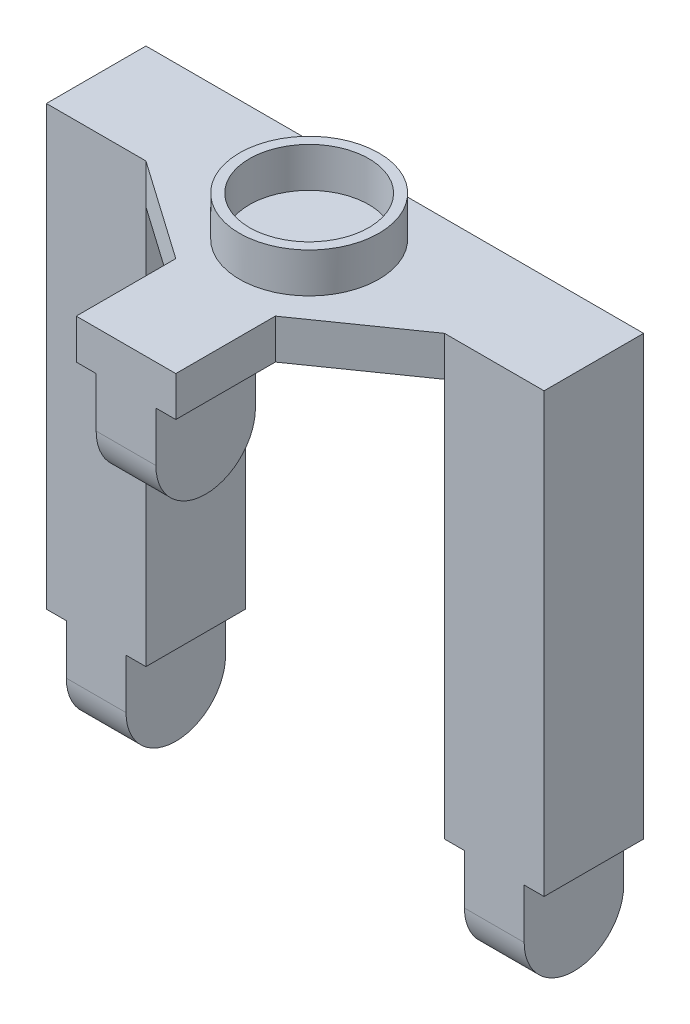
ISO-10303-21;
HEADER;
FILE_DESCRIPTION(('STEP AP214'),'2;1');
FILE_NAME('part.step','',(''),(''),'','','');
FILE_SCHEMA(('AUTOMOTIVE_DESIGN { 1 0 10303 214 1 1 1 1 }'));
ENDSEC;
DATA;
#1=APPLICATION_CONTEXT('core data for automotive mechanical design processes');
#2=APPLICATION_PROTOCOL_DEFINITION('international standard','automotive_design',2000,#1);
#3=PRODUCT_CONTEXT('',#1,'mechanical');
#4=PRODUCT('Part','Part','',(#3));
#5=PRODUCT_RELATED_PRODUCT_CATEGORY('part','',(#4));
#6=PRODUCT_DEFINITION_FORMATION('','',#4);
#7=PRODUCT_DEFINITION_CONTEXT('part definition',#1,'design');
#8=PRODUCT_DEFINITION('design','',#6,#7);
#9=PRODUCT_DEFINITION_SHAPE('','',#8);
#10=(LENGTH_UNIT() NAMED_UNIT(*) SI_UNIT(.MILLI.,.METRE.));
#11=(NAMED_UNIT(*) PLANE_ANGLE_UNIT() SI_UNIT($,.RADIAN.));
#12=(NAMED_UNIT(*) SI_UNIT($,.STERADIAN.) SOLID_ANGLE_UNIT());
#13=UNCERTAINTY_MEASURE_WITH_UNIT(LENGTH_MEASURE(1.E-05),#10,'distance_accuracy_value','');
#14=(GEOMETRIC_REPRESENTATION_CONTEXT(3) GLOBAL_UNCERTAINTY_ASSIGNED_CONTEXT((#13)) GLOBAL_UNIT_ASSIGNED_CONTEXT((#10,
#11,#12)) REPRESENTATION_CONTEXT('',''));
#15=CARTESIAN_POINT('',(0.,0.,0.));
#16=DIRECTION('',(0.,0.,1.));
#17=DIRECTION('',(1.,0.,0.));
#18=AXIS2_PLACEMENT_3D('',#15,#16,#17);
#19=CARTESIAN_POINT('',(-25.,4.,5.));
#20=DIRECTION('',(0.,0.,-1.));
#21=DIRECTION('',(-1.,0.,0.));
#22=AXIS2_PLACEMENT_3D('',#19,#20,#21);
#23=PLANE('',#22);
#24=DIRECTION('',(1.,0.,0.));
#25=VECTOR('',#24,1.);
#26=CARTESIAN_POINT('',(-25.,-45.,5.00000000000001));
#27=LINE('',#26,#25);
#28=CARTESIAN_POINT('',(-23.,-45.,5.00000000000001));
#29=VERTEX_POINT('',#28);
#30=CARTESIAN_POINT('',(-17.,-45.,5.00000000000001));
#31=VERTEX_POINT('',#30);
#32=EDGE_CURVE('E199',#29,#31,#27,.T.);
#33=ORIENTED_EDGE('',*,*,#32,.T.);
#34=DIRECTION('',(0.,1.,0.));
#35=VECTOR('',#34,1.);
#36=CARTESIAN_POINT('',(-17.,4.,5.));
#37=LINE('',#36,#35);
#38=CARTESIAN_POINT('',(-17.,-40.,5.));
#39=VERTEX_POINT('',#38);
#40=EDGE_CURVE('E224',#31,#39,#37,.T.);
#41=ORIENTED_EDGE('',*,*,#40,.T.);
#42=DIRECTION('',(1.,0.,0.));
#43=VECTOR('',#42,1.);
#44=CARTESIAN_POINT('',(-25.,-40.,5.));
#45=LINE('',#44,#43);
#46=CARTESIAN_POINT('',(-15.,-40.,5.));
#47=VERTEX_POINT('',#46);
#48=EDGE_CURVE('E225',#39,#47,#45,.T.);
#49=ORIENTED_EDGE('',*,*,#48,.T.);
#50=DIRECTION('',(0.,1.,0.));
#51=VECTOR('',#50,1.);
#52=CARTESIAN_POINT('',(-15.,-50.,5.));
#53=LINE('',#52,#51);
#54=CARTESIAN_POINT('',(-15.,0.,5.));
#55=VERTEX_POINT('',#54);
#56=EDGE_CURVE('E251',#47,#55,#53,.T.);
#57=ORIENTED_EDGE('',*,*,#56,.T.);
#58=DIRECTION('',(0.,-1.,0.));
#59=VECTOR('',#58,1.);
#60=CARTESIAN_POINT('',(-15.,4.,5.));
#61=LINE('',#60,#59);
#62=CARTESIAN_POINT('',(-15.,4.,5.));
#63=VERTEX_POINT('',#62);
#64=EDGE_CURVE('E309',#63,#55,#61,.T.);
#65=ORIENTED_EDGE('',*,*,#64,.F.);
#66=DIRECTION('',(1.,0.,0.));
#67=VECTOR('',#66,1.);
#68=CARTESIAN_POINT('',(-25.,4.,5.));
#69=LINE('',#68,#67);
#70=CARTESIAN_POINT('',(-25.,4.,5.));
#71=VERTEX_POINT('',#70);
#72=EDGE_CURVE('E257',#71,#63,#69,.T.);
#73=ORIENTED_EDGE('',*,*,#72,.F.);
#74=DIRECTION('',(0.,-1.,0.));
#75=VECTOR('',#74,1.);
#76=CARTESIAN_POINT('',(-25.,4.,5.));
#77=LINE('',#76,#75);
#78=CARTESIAN_POINT('',(-25.,-40.,5.));
#79=VERTEX_POINT('',#78);
#80=EDGE_CURVE('E279',#71,#79,#77,.T.);
#81=ORIENTED_EDGE('',*,*,#80,.T.);
#82=DIRECTION('',(1.,0.,0.));
#83=VECTOR('',#82,1.);
#84=CARTESIAN_POINT('',(-25.,-40.,5.));
#85=LINE('',#84,#83);
#86=CARTESIAN_POINT('',(-23.,-40.,5.));
#87=VERTEX_POINT('',#86);
#88=EDGE_CURVE('E223',#79,#87,#85,.T.);
#89=ORIENTED_EDGE('',*,*,#88,.T.);
#90=DIRECTION('',(0.,-1.,0.));
#91=VECTOR('',#90,1.);
#92=CARTESIAN_POINT('',(-23.,4.,5.));
#93=LINE('',#92,#91);
#94=EDGE_CURVE('E215',#87,#29,#93,.T.);
#95=ORIENTED_EDGE('',*,*,#94,.T.);
#96=EDGE_LOOP('',(#33,#41,#49,#57,#65,#73,#81,#89,#95));
#97=FACE_BOUND('',#96,.T.);
#98=ADVANCED_FACE('F34',(#97),#23,.F.);
#99=CARTESIAN_POINT('',(-5.,4.,22.));
#100=DIRECTION('',(0.,0.,-1.));
#101=DIRECTION('',(-1.,0.,0.));
#102=AXIS2_PLACEMENT_3D('',#99,#100,#101);
#103=PLANE('',#102);
#104=DIRECTION('',(1.,0.,0.));
#105=VECTOR('',#104,1.);
#106=CARTESIAN_POINT('',(-25.,-5.,22.));
#107=LINE('',#106,#105);
#108=CARTESIAN_POINT('',(-3.,-5.,22.));
#109=VERTEX_POINT('',#108);
#110=CARTESIAN_POINT('',(3.,-5.,22.));
#111=VERTEX_POINT('',#110);
#112=EDGE_CURVE('E48',#109,#111,#107,.T.);
#113=ORIENTED_EDGE('',*,*,#112,.T.);
#114=DIRECTION('',(0.,1.,0.));
#115=VECTOR('',#114,1.);
#116=CARTESIAN_POINT('',(3.,-10.,22.));
#117=LINE('',#116,#115);
#118=CARTESIAN_POINT('',(3.,0.,22.));
#119=VERTEX_POINT('',#118);
#120=EDGE_CURVE('E331',#111,#119,#117,.T.);
#121=ORIENTED_EDGE('',*,*,#120,.T.);
#122=DIRECTION('',(1.,0.,0.));
#123=VECTOR('',#122,1.);
#124=CARTESIAN_POINT('',(7.92883032803164,0.,22.));
#125=LINE('',#124,#123);
#126=CARTESIAN_POINT('',(5.,0.,22.));
#127=VERTEX_POINT('',#126);
#128=EDGE_CURVE('E360',#119,#127,#125,.T.);
#129=ORIENTED_EDGE('',*,*,#128,.T.);
#130=DIRECTION('',(0.,-1.,0.));
#131=VECTOR('',#130,1.);
#132=CARTESIAN_POINT('',(5.,4.,22.));
#133=LINE('',#132,#131);
#134=CARTESIAN_POINT('',(5.,4.,22.));
#135=VERTEX_POINT('',#134);
#136=EDGE_CURVE('E300',#135,#127,#133,.T.);
#137=ORIENTED_EDGE('',*,*,#136,.F.);
#138=DIRECTION('',(1.,0.,0.));
#139=VECTOR('',#138,1.);
#140=CARTESIAN_POINT('',(-5.,4.,22.));
#141=LINE('',#140,#139);
#142=CARTESIAN_POINT('',(-5.,4.,22.));
#143=VERTEX_POINT('',#142);
#144=EDGE_CURVE('E265',#143,#135,#141,.T.);
#145=ORIENTED_EDGE('',*,*,#144,.F.);
#146=DIRECTION('',(0.,-1.,0.));
#147=VECTOR('',#146,1.);
#148=CARTESIAN_POINT('',(-5.,4.,22.));
#149=LINE('',#148,#147);
#150=CARTESIAN_POINT('',(-5.,0.,22.));
#151=VERTEX_POINT('',#150);
#152=EDGE_CURVE('E303',#143,#151,#149,.T.);
#153=ORIENTED_EDGE('',*,*,#152,.T.);
#154=DIRECTION('',(1.,0.,0.));
#155=VECTOR('',#154,1.);
#156=CARTESIAN_POINT('',(-3.,0.,22.));
#157=LINE('',#156,#155);
#158=CARTESIAN_POINT('',(-3.,0.,22.));
#159=VERTEX_POINT('',#158);
#160=EDGE_CURVE('E328',#151,#159,#157,.T.);
#161=ORIENTED_EDGE('',*,*,#160,.T.);
#162=DIRECTION('',(0.,-1.,0.));
#163=VECTOR('',#162,1.);
#164=CARTESIAN_POINT('',(-3.,-10.,22.));
#165=LINE('',#164,#163);
#166=EDGE_CURVE('E320',#159,#109,#165,.T.);
#167=ORIENTED_EDGE('',*,*,#166,.T.);
#168=EDGE_LOOP('',(#113,#121,#129,#137,#145,#153,#161,#167));
#169=FACE_BOUND('',#168,.T.);
#170=ADVANCED_FACE('F326',(#169),#103,.F.);
#171=CARTESIAN_POINT('',(15.,4.,5.));
#172=DIRECTION('',(0.,0.,-1.));
#173=DIRECTION('',(-1.,0.,0.));
#174=AXIS2_PLACEMENT_3D('',#171,#172,#173);
#175=PLANE('',#174);
#176=CARTESIAN_POINT('',(17.,-45.,4.99999999999999));
#177=VERTEX_POINT('',#176);
#178=CARTESIAN_POINT('',(23.,-45.,4.99999999999999));
#179=VERTEX_POINT('',#178);
#180=EDGE_CURVE('E210',#177,#179,#27,.T.);
#181=ORIENTED_EDGE('',*,*,#180,.T.);
#182=DIRECTION('',(0.,1.,0.));
#183=VECTOR('',#182,1.);
#184=CARTESIAN_POINT('',(23.,4.,5.));
#185=LINE('',#184,#183);
#186=CARTESIAN_POINT('',(23.,-40.,5.));
#187=VERTEX_POINT('',#186);
#188=EDGE_CURVE('E378',#179,#187,#185,.T.);
#189=ORIENTED_EDGE('',*,*,#188,.T.);
#190=DIRECTION('',(1.,0.,0.));
#191=VECTOR('',#190,1.);
#192=CARTESIAN_POINT('',(15.,-40.,5.));
#193=LINE('',#192,#191);
#194=CARTESIAN_POINT('',(25.,-40.,5.));
#195=VERTEX_POINT('',#194);
#196=EDGE_CURVE('E234',#187,#195,#193,.T.);
#197=ORIENTED_EDGE('',*,*,#196,.T.);
#198=DIRECTION('',(0.,-1.,0.));
#199=VECTOR('',#198,1.);
#200=CARTESIAN_POINT('',(25.,4.,5.));
#201=LINE('',#200,#199);
#202=CARTESIAN_POINT('',(25.,4.,5.));
#203=VERTEX_POINT('',#202);
#204=EDGE_CURVE('E291',#203,#195,#201,.T.);
#205=ORIENTED_EDGE('',*,*,#204,.F.);
#206=DIRECTION('',(1.,0.,0.));
#207=VECTOR('',#206,1.);
#208=CARTESIAN_POINT('',(15.,4.,5.));
#209=LINE('',#208,#207);
#210=CARTESIAN_POINT('',(15.,4.,5.));
#211=VERTEX_POINT('',#210);
#212=EDGE_CURVE('E271',#211,#203,#209,.T.);
#213=ORIENTED_EDGE('',*,*,#212,.F.);
#214=DIRECTION('',(0.,-1.,0.));
#215=VECTOR('',#214,1.);
#216=CARTESIAN_POINT('',(15.,4.,5.));
#217=LINE('',#216,#215);
#218=CARTESIAN_POINT('',(15.,0.,5.));
#219=VERTEX_POINT('',#218);
#220=EDGE_CURVE('E294',#211,#219,#217,.T.);
#221=ORIENTED_EDGE('',*,*,#220,.T.);
#222=DIRECTION('',(0.,1.,0.));
#223=VECTOR('',#222,1.);
#224=CARTESIAN_POINT('',(15.,-50.,5.));
#225=LINE('',#224,#223);
#226=CARTESIAN_POINT('',(15.,-40.,5.));
#227=VERTEX_POINT('',#226);
#228=EDGE_CURVE('E243',#227,#219,#225,.T.);
#229=ORIENTED_EDGE('',*,*,#228,.F.);
#230=DIRECTION('',(1.,0.,0.));
#231=VECTOR('',#230,1.);
#232=CARTESIAN_POINT('',(15.,-40.,5.));
#233=LINE('',#232,#231);
#234=CARTESIAN_POINT('',(17.,-40.,5.));
#235=VERTEX_POINT('',#234);
#236=EDGE_CURVE('E380',#227,#235,#233,.T.);
#237=ORIENTED_EDGE('',*,*,#236,.T.);
#238=DIRECTION('',(0.,-1.,0.));
#239=VECTOR('',#238,1.);
#240=CARTESIAN_POINT('',(17.,4.,5.));
#241=LINE('',#240,#239);
#242=EDGE_CURVE('E375',#235,#177,#241,.T.);
#243=ORIENTED_EDGE('',*,*,#242,.T.);
#244=EDGE_LOOP('',(#181,#189,#197,#205,#213,#221,#229,#237,#243));
#245=FACE_BOUND('',#244,.T.);
#246=ADVANCED_FACE('F450',(#245),#175,.F.);
#247=CARTESIAN_POINT('',(0.,0.,0.));
#248=DIRECTION('',(0.,-1.,0.));
#249=DIRECTION('',(0.,0.,-1.));
#250=AXIS2_PLACEMENT_3D('',#247,#248,#249);
#251=PLANE('',#250);
#252=DIRECTION('',(0.,0.,-1.));
#253=VECTOR('',#252,1.);
#254=CARTESIAN_POINT('',(-15.,0.,-5.));
#255=LINE('',#254,#253);
#256=CARTESIAN_POINT('',(-15.,0.,-5.));
#257=VERTEX_POINT('',#256);
#258=EDGE_CURVE('E246',#55,#257,#255,.T.);
#259=ORIENTED_EDGE('',*,*,#258,.T.);
#260=DIRECTION('',(-1.,0.,0.));
#261=VECTOR('',#260,1.);
#262=CARTESIAN_POINT('',(25.,0.,-5.));
#263=LINE('',#262,#261);
#264=CARTESIAN_POINT('',(15.,0.,-5.));
#265=VERTEX_POINT('',#264);
#266=EDGE_CURVE('E261',#265,#257,#263,.T.);
#267=ORIENTED_EDGE('',*,*,#266,.F.);
#268=DIRECTION('',(0.,0.,1.));
#269=VECTOR('',#268,1.);
#270=CARTESIAN_POINT('',(15.,0.,-5.));
#271=LINE('',#270,#269);
#272=EDGE_CURVE('E240',#265,#219,#271,.T.);
#273=ORIENTED_EDGE('',*,*,#272,.T.);
#274=DIRECTION('',(0.81923192051904,0.,-0.573462344363329));
#275=VECTOR('',#274,1.);
#276=CARTESIAN_POINT('',(5.,0.,12.));
#277=LINE('',#276,#275);
#278=CARTESIAN_POINT('',(5.,0.,12.));
#279=VERTEX_POINT('',#278);
#280=EDGE_CURVE('E281',#279,#219,#277,.T.);
#281=ORIENTED_EDGE('',*,*,#280,.F.);
#282=DIRECTION('',(0.,0.,-1.));
#283=VECTOR('',#282,1.);
#284=CARTESIAN_POINT('',(5.,0.,22.));
#285=LINE('',#284,#283);
#286=EDGE_CURVE('E370',#127,#279,#285,.T.);
#287=ORIENTED_EDGE('',*,*,#286,.F.);
#288=ORIENTED_EDGE('',*,*,#128,.F.);
#289=DIRECTION('',(0.,0.,-1.));
#290=VECTOR('',#289,1.);
#291=CARTESIAN_POINT('',(3.,0.,22.));
#292=LINE('',#291,#290);
#293=CARTESIAN_POINT('',(3.,0.,12.));
#294=VERTEX_POINT('',#293);
#295=EDGE_CURVE('E352',#119,#294,#292,.T.);
#296=ORIENTED_EDGE('',*,*,#295,.T.);
#297=DIRECTION('',(1.,0.,0.));
#298=VECTOR('',#297,1.);
#299=CARTESIAN_POINT('',(-5.,0.,12.));
#300=LINE('',#299,#298);
#301=CARTESIAN_POINT('',(-3.,0.,12.));
#302=VERTEX_POINT('',#301);
#303=EDGE_CURVE('E237',#302,#294,#300,.T.);
#304=ORIENTED_EDGE('',*,*,#303,.F.);
#305=DIRECTION('',(0.,0.,-1.));
#306=VECTOR('',#305,1.);
#307=CARTESIAN_POINT('',(-3.,0.,22.));
#308=LINE('',#307,#306);
#309=EDGE_CURVE('E329',#159,#302,#308,.T.);
#310=ORIENTED_EDGE('',*,*,#309,.F.);
#311=ORIENTED_EDGE('',*,*,#160,.F.);
#312=DIRECTION('',(0.,0.,1.));
#313=VECTOR('',#312,1.);
#314=CARTESIAN_POINT('',(-5.,0.,12.));
#315=LINE('',#314,#313);
#316=CARTESIAN_POINT('',(-5.,0.,12.));
#317=VERTEX_POINT('',#316);
#318=EDGE_CURVE('E372',#317,#151,#315,.T.);
#319=ORIENTED_EDGE('',*,*,#318,.F.);
#320=DIRECTION('',(0.81923192051904,0.,0.573462344363328));
#321=VECTOR('',#320,1.);
#322=CARTESIAN_POINT('',(-15.,0.,5.));
#323=LINE('',#322,#321);
#324=EDGE_CURVE('E255',#55,#317,#323,.T.);
#325=ORIENTED_EDGE('',*,*,#324,.F.);
#326=EDGE_LOOP('',(#259,#267,#273,#281,#287,#288,#296,#304,#310,#311,#319,#325));
#327=FACE_BOUND('',#326,.T.);
#328=ADVANCED_FACE('F398',(#327),#251,.T.);
#329=CARTESIAN_POINT('',(-15.,4.,5.));
#330=DIRECTION('',(0.573462344363329,0.,-0.81923192051904));
#331=DIRECTION('',(-0.81923192051904,0.,-0.573462344363329));
#332=AXIS2_PLACEMENT_3D('',#329,#330,#331);
#333=PLANE('',#332);
#334=ORIENTED_EDGE('',*,*,#324,.T.);
#335=DIRECTION('',(0.,-1.,0.));
#336=VECTOR('',#335,1.);
#337=CARTESIAN_POINT('',(-5.,4.,12.));
#338=LINE('',#337,#336);
#339=CARTESIAN_POINT('',(-5.,4.,12.));
#340=VERTEX_POINT('',#339);
#341=EDGE_CURVE('E306',#340,#317,#338,.T.);
#342=ORIENTED_EDGE('',*,*,#341,.F.);
#343=DIRECTION('',(0.81923192051904,0.,0.573462344363328));
#344=VECTOR('',#343,1.);
#345=CARTESIAN_POINT('',(-15.,4.,5.));
#346=LINE('',#345,#344);
#347=EDGE_CURVE('E260',#63,#340,#346,.T.);
#348=ORIENTED_EDGE('',*,*,#347,.F.);
#349=ORIENTED_EDGE('',*,*,#64,.T.);
#350=EDGE_LOOP('',(#334,#342,#348,#349));
#351=FACE_BOUND('',#350,.T.);
#352=ADVANCED_FACE('F401',(#351),#333,.F.);
#353=CARTESIAN_POINT('',(-5.,4.,12.));
#354=DIRECTION('',(1.,0.,0.));
#355=DIRECTION('',(0.,0.,-1.));
#356=AXIS2_PLACEMENT_3D('',#353,#354,#355);
#357=PLANE('',#356);
#358=ORIENTED_EDGE('',*,*,#341,.T.);
#359=ORIENTED_EDGE('',*,*,#318,.T.);
#360=ORIENTED_EDGE('',*,*,#152,.F.);
#361=DIRECTION('',(0.,0.,1.));
#362=VECTOR('',#361,1.);
#363=CARTESIAN_POINT('',(-5.,4.,12.));
#364=LINE('',#363,#362);
#365=EDGE_CURVE('E263',#340,#143,#364,.T.);
#366=ORIENTED_EDGE('',*,*,#365,.F.);
#367=EDGE_LOOP('',(#358,#359,#360,#366));
#368=FACE_BOUND('',#367,.T.);
#369=ADVANCED_FACE('F476',(#368),#357,.F.);
#370=CARTESIAN_POINT('',(5.,4.,22.));
#371=DIRECTION('',(-1.,0.,0.));
#372=DIRECTION('',(0.,0.,1.));
#373=AXIS2_PLACEMENT_3D('',#370,#371,#372);
#374=PLANE('',#373);
#375=ORIENTED_EDGE('',*,*,#136,.T.);
#376=ORIENTED_EDGE('',*,*,#286,.T.);
#377=DIRECTION('',(0.,-1.,0.));
#378=VECTOR('',#377,1.);
#379=CARTESIAN_POINT('',(5.,4.,12.));
#380=LINE('',#379,#378);
#381=CARTESIAN_POINT('',(5.,4.,12.));
#382=VERTEX_POINT('',#381);
#383=EDGE_CURVE('E297',#382,#279,#380,.T.);
#384=ORIENTED_EDGE('',*,*,#383,.F.);
#385=DIRECTION('',(0.,0.,-1.));
#386=VECTOR('',#385,1.);
#387=CARTESIAN_POINT('',(5.,4.,22.));
#388=LINE('',#387,#386);
#389=EDGE_CURVE('E267',#135,#382,#388,.T.);
#390=ORIENTED_EDGE('',*,*,#389,.F.);
#391=EDGE_LOOP('',(#375,#376,#384,#390));
#392=FACE_BOUND('',#391,.T.);
#393=ADVANCED_FACE('F474',(#392),#374,.F.);
#394=CARTESIAN_POINT('',(5.,4.,12.));
#395=DIRECTION('',(-0.573462344363329,0.,-0.81923192051904));
#396=DIRECTION('',(-0.81923192051904,0.,0.573462344363329));
#397=AXIS2_PLACEMENT_3D('',#394,#395,#396);
#398=PLANE('',#397);
#399=ORIENTED_EDGE('',*,*,#280,.T.);
#400=ORIENTED_EDGE('',*,*,#220,.F.);
#401=DIRECTION('',(0.81923192051904,0.,-0.573462344363329));
#402=VECTOR('',#401,1.);
#403=CARTESIAN_POINT('',(5.,4.,12.));
#404=LINE('',#403,#402);
#405=EDGE_CURVE('E269',#382,#211,#404,.T.);
#406=ORIENTED_EDGE('',*,*,#405,.F.);
#407=ORIENTED_EDGE('',*,*,#383,.T.);
#408=EDGE_LOOP('',(#399,#400,#406,#407));
#409=FACE_BOUND('',#408,.T.);
#410=ADVANCED_FACE('F494',(#409),#398,.F.);
#411=CARTESIAN_POINT('',(25.,4.,5.));
#412=DIRECTION('',(-1.,0.,0.));
#413=DIRECTION('',(0.,0.,1.));
#414=AXIS2_PLACEMENT_3D('',#411,#412,#413);
#415=PLANE('',#414);
#416=ORIENTED_EDGE('',*,*,#204,.T.);
#417=DIRECTION('',(0.,0.,-1.));
#418=VECTOR('',#417,1.);
#419=CARTESIAN_POINT('',(25.,-40.,22.));
#420=LINE('',#419,#418);
#421=CARTESIAN_POINT('',(25.,-40.,-5.));
#422=VERTEX_POINT('',#421);
#423=EDGE_CURVE('E368',#195,#422,#420,.T.);
#424=ORIENTED_EDGE('',*,*,#423,.T.);
#425=DIRECTION('',(0.,-1.,0.));
#426=VECTOR('',#425,1.);
#427=CARTESIAN_POINT('',(25.,4.,-5.));
#428=LINE('',#427,#426);
#429=CARTESIAN_POINT('',(25.,4.,-5.));
#430=VERTEX_POINT('',#429);
#431=EDGE_CURVE('E288',#430,#422,#428,.T.);
#432=ORIENTED_EDGE('',*,*,#431,.F.);
#433=DIRECTION('',(0.,0.,-1.));
#434=VECTOR('',#433,1.);
#435=CARTESIAN_POINT('',(25.,4.,5.));
#436=LINE('',#435,#434);
#437=EDGE_CURVE('E273',#203,#430,#436,.T.);
#438=ORIENTED_EDGE('',*,*,#437,.F.);
#439=EDGE_LOOP('',(#416,#424,#432,#438));
#440=FACE_BOUND('',#439,.T.);
#441=ADVANCED_FACE('F447',(#440),#415,.F.);
#442=CARTESIAN_POINT('',(25.,4.,-5.));
#443=DIRECTION('',(0.,0.,1.));
#444=DIRECTION('',(1.,0.,0.));
#445=AXIS2_PLACEMENT_3D('',#442,#443,#444);
#446=PLANE('',#445);
#447=DIRECTION('',(0.,1.,0.));
#448=VECTOR('',#447,1.);
#449=CARTESIAN_POINT('',(23.,-50.,-5.));
#450=LINE('',#449,#448);
#451=CARTESIAN_POINT('',(23.,-45.,-5.));
#452=VERTEX_POINT('',#451);
#453=CARTESIAN_POINT('',(23.,-40.,-5.));
#454=VERTEX_POINT('',#453);
#455=EDGE_CURVE('E357',#452,#454,#450,.T.);
#456=ORIENTED_EDGE('',*,*,#455,.F.);
#457=DIRECTION('',(1.,0.,0.));
#458=VECTOR('',#457,1.);
#459=CARTESIAN_POINT('',(-25.,-45.,-4.99999999999999));
#460=LINE('',#459,#458);
#461=CARTESIAN_POINT('',(17.,-45.,-5.00000000000001));
#462=VERTEX_POINT('',#461);
#463=EDGE_CURVE('E209',#462,#452,#460,.T.);
#464=ORIENTED_EDGE('',*,*,#463,.F.);
#465=DIRECTION('',(0.,-1.,0.));
#466=VECTOR('',#465,1.);
#467=CARTESIAN_POINT('',(17.,-50.,-5.));
#468=LINE('',#467,#466);
#469=CARTESIAN_POINT('',(17.,-40.,-5.));
#470=VERTEX_POINT('',#469);
#471=EDGE_CURVE('E339',#470,#462,#468,.T.);
#472=ORIENTED_EDGE('',*,*,#471,.F.);
#473=DIRECTION('',(1.,0.,0.));
#474=VECTOR('',#473,1.);
#475=CARTESIAN_POINT('',(17.,-40.,-5.));
#476=LINE('',#475,#474);
#477=CARTESIAN_POINT('',(15.,-40.,-5.));
#478=VERTEX_POINT('',#477);
#479=EDGE_CURVE('E340',#478,#470,#476,.T.);
#480=ORIENTED_EDGE('',*,*,#479,.F.);
#481=DIRECTION('',(0.,1.,0.));
#482=VECTOR('',#481,1.);
#483=CARTESIAN_POINT('',(15.,-50.,-5.));
#484=LINE('',#483,#482);
#485=EDGE_CURVE('E244',#478,#265,#484,.T.);
#486=ORIENTED_EDGE('',*,*,#485,.T.);
#487=ORIENTED_EDGE('',*,*,#266,.T.);
#488=DIRECTION('',(0.,1.,0.));
#489=VECTOR('',#488,1.);
#490=CARTESIAN_POINT('',(-15.,-50.,-5.));
#491=LINE('',#490,#489);
#492=CARTESIAN_POINT('',(-15.,-40.,-5.));
#493=VERTEX_POINT('',#492);
#494=EDGE_CURVE('E252',#493,#257,#491,.T.);
#495=ORIENTED_EDGE('',*,*,#494,.F.);
#496=CARTESIAN_POINT('',(-17.,-40.,-5.));
#497=VERTEX_POINT('',#496);
#498=EDGE_CURVE('E337',#497,#493,#476,.T.);
#499=ORIENTED_EDGE('',*,*,#498,.F.);
#500=DIRECTION('',(0.,1.,0.));
#501=VECTOR('',#500,1.);
#502=CARTESIAN_POINT('',(-17.,-50.,-5.));
#503=LINE('',#502,#501);
#504=CARTESIAN_POINT('',(-17.,-45.,-5.));
#505=VERTEX_POINT('',#504);
#506=EDGE_CURVE('E343',#505,#497,#503,.T.);
#507=ORIENTED_EDGE('',*,*,#506,.F.);
#508=CARTESIAN_POINT('',(-23.,-45.,-4.99999999999999));
#509=VERTEX_POINT('',#508);
#510=EDGE_CURVE('E419',#509,#505,#460,.T.);
#511=ORIENTED_EDGE('',*,*,#510,.F.);
#512=DIRECTION('',(0.,-1.,0.));
#513=VECTOR('',#512,1.);
#514=CARTESIAN_POINT('',(-23.,-50.,-5.));
#515=LINE('',#514,#513);
#516=CARTESIAN_POINT('',(-23.,-40.,-5.));
#517=VERTEX_POINT('',#516);
#518=EDGE_CURVE('E218',#517,#509,#515,.T.);
#519=ORIENTED_EDGE('',*,*,#518,.F.);
#520=DIRECTION('',(1.,0.,0.));
#521=VECTOR('',#520,1.);
#522=CARTESIAN_POINT('',(-23.,-40.,-5.));
#523=LINE('',#522,#521);
#524=CARTESIAN_POINT('',(-25.,-40.,-5.));
#525=VERTEX_POINT('',#524);
#526=EDGE_CURVE('E349',#525,#517,#523,.T.);
#527=ORIENTED_EDGE('',*,*,#526,.F.);
#528=DIRECTION('',(0.,-1.,0.));
#529=VECTOR('',#528,1.);
#530=CARTESIAN_POINT('',(-25.,4.,-5.));
#531=LINE('',#530,#529);
#532=CARTESIAN_POINT('',(-25.,4.,-5.));
#533=VERTEX_POINT('',#532);
#534=EDGE_CURVE('E285',#533,#525,#531,.T.);
#535=ORIENTED_EDGE('',*,*,#534,.F.);
#536=DIRECTION('',(-1.,0.,0.));
#537=VECTOR('',#536,1.);
#538=CARTESIAN_POINT('',(25.,4.,-5.));
#539=LINE('',#538,#537);
#540=EDGE_CURVE('E275',#430,#533,#539,.T.);
#541=ORIENTED_EDGE('',*,*,#540,.F.);
#542=ORIENTED_EDGE('',*,*,#431,.T.);
#543=DIRECTION('',(1.,0.,0.));
#544=VECTOR('',#543,1.);
#545=CARTESIAN_POINT('',(25.,-40.,-5.));
#546=LINE('',#545,#544);
#547=EDGE_CURVE('E433',#454,#422,#546,.T.);
#548=ORIENTED_EDGE('',*,*,#547,.F.);
#549=EDGE_LOOP('',(#456,#464,#472,#480,#486,#487,#495,#499,#507,#511,#519,#527,#535,#541,#542,#548));
#550=FACE_BOUND('',#549,.T.);
#551=ADVANCED_FACE('F417',(#550),#446,.F.);
#552=CARTESIAN_POINT('',(-25.,4.,-5.));
#553=DIRECTION('',(1.,0.,0.));
#554=DIRECTION('',(0.,0.,-1.));
#555=AXIS2_PLACEMENT_3D('',#552,#553,#554);
#556=PLANE('',#555);
#557=ORIENTED_EDGE('',*,*,#534,.T.);
#558=DIRECTION('',(0.,0.,-1.));
#559=VECTOR('',#558,1.);
#560=CARTESIAN_POINT('',(-25.,-40.,22.));
#561=LINE('',#560,#559);
#562=EDGE_CURVE('E355',#79,#525,#561,.T.);
#563=ORIENTED_EDGE('',*,*,#562,.F.);
#564=ORIENTED_EDGE('',*,*,#80,.F.);
#565=DIRECTION('',(0.,0.,1.));
#566=VECTOR('',#565,1.);
#567=CARTESIAN_POINT('',(-25.,4.,-5.));
#568=LINE('',#567,#566);
#569=EDGE_CURVE('E277',#533,#71,#568,.T.);
#570=ORIENTED_EDGE('',*,*,#569,.F.);
#571=EDGE_LOOP('',(#557,#563,#564,#570));
#572=FACE_BOUND('',#571,.T.);
#573=ADVANCED_FACE('F411',(#572),#556,.F.);
#574=CARTESIAN_POINT('',(0.,4.,0.));
#575=DIRECTION('',(0.,-1.,0.));
#576=DIRECTION('',(0.,0.,-1.));
#577=AXIS2_PLACEMENT_3D('',#574,#575,#576);
#578=PLANE('',#577);
#579=CARTESIAN_POINT('',(0.,4.,3.6));
#580=DIRECTION('',(0.,-1.,0.));
#581=DIRECTION('',(0.,0.,-1.));
#582=AXIS2_PLACEMENT_3D('',#579,#580,#581);
#583=CIRCLE('',#582,7.);
#584=CARTESIAN_POINT('',(0.,4.,-3.4));
#585=VERTEX_POINT('',#584);
#586=EDGE_CURVE('E11',#585,#585,#583,.F.);
#587=ORIENTED_EDGE('',*,*,#586,.F.);
#588=EDGE_LOOP('',(#587));
#589=FACE_BOUND('',#588,.T.);
#590=ORIENTED_EDGE('',*,*,#72,.T.);
#591=ORIENTED_EDGE('',*,*,#347,.T.);
#592=ORIENTED_EDGE('',*,*,#365,.T.);
#593=ORIENTED_EDGE('',*,*,#144,.T.);
#594=ORIENTED_EDGE('',*,*,#389,.T.);
#595=ORIENTED_EDGE('',*,*,#405,.T.);
#596=ORIENTED_EDGE('',*,*,#212,.T.);
#597=ORIENTED_EDGE('',*,*,#437,.T.);
#598=ORIENTED_EDGE('',*,*,#540,.T.);
#599=ORIENTED_EDGE('',*,*,#569,.T.);
#600=EDGE_LOOP('',(#590,#591,#592,#593,#594,#595,#596,#597,#598,#599));
#601=FACE_BOUND('',#600,.T.);
#602=ADVANCED_FACE('F405',(#589,#601),#578,.F.);
#603=CARTESIAN_POINT('',(-15.,-50.,-5.));
#604=DIRECTION('',(1.,0.,0.));
#605=DIRECTION('',(0.,0.,-1.));
#606=AXIS2_PLACEMENT_3D('',#603,#604,#605);
#607=PLANE('',#606);
#608=DIRECTION('',(0.,0.,1.));
#609=VECTOR('',#608,1.);
#610=CARTESIAN_POINT('',(-15.,-40.,-5.));
#611=LINE('',#610,#609);
#612=EDGE_CURVE('E229',#493,#47,#611,.T.);
#613=ORIENTED_EDGE('',*,*,#612,.F.);
#614=ORIENTED_EDGE('',*,*,#494,.T.);
#615=ORIENTED_EDGE('',*,*,#258,.F.);
#616=ORIENTED_EDGE('',*,*,#56,.F.);
#617=EDGE_LOOP('',(#613,#614,#615,#616));
#618=FACE_BOUND('',#617,.T.);
#619=ADVANCED_FACE('F393',(#618),#607,.T.);
#620=CARTESIAN_POINT('',(15.,-50.,-5.));
#621=DIRECTION('',(-1.,0.,0.));
#622=DIRECTION('',(0.,0.,1.));
#623=AXIS2_PLACEMENT_3D('',#620,#621,#622);
#624=PLANE('',#623);
#625=DIRECTION('',(0.,0.,-1.));
#626=VECTOR('',#625,1.);
#627=CARTESIAN_POINT('',(15.,-40.,-5.));
#628=LINE('',#627,#626);
#629=EDGE_CURVE('E312',#227,#478,#628,.T.);
#630=ORIENTED_EDGE('',*,*,#629,.F.);
#631=ORIENTED_EDGE('',*,*,#228,.T.);
#632=ORIENTED_EDGE('',*,*,#272,.F.);
#633=ORIENTED_EDGE('',*,*,#485,.F.);
#634=EDGE_LOOP('',(#630,#631,#632,#633));
#635=FACE_BOUND('',#634,.T.);
#636=ADVANCED_FACE('F509',(#635),#624,.T.);
#637=CARTESIAN_POINT('',(-5.,-10.,12.));
#638=DIRECTION('',(0.,0.,1.));
#639=DIRECTION('',(1.,0.,0.));
#640=AXIS2_PLACEMENT_3D('',#637,#638,#639);
#641=PLANE('',#640);
#642=DIRECTION('',(0.,-1.,0.));
#643=VECTOR('',#642,1.);
#644=CARTESIAN_POINT('',(3.,-10.,12.));
#645=LINE('',#644,#643);
#646=CARTESIAN_POINT('',(3.,-5.,12.));
#647=VERTEX_POINT('',#646);
#648=EDGE_CURVE('E365',#294,#647,#645,.T.);
#649=ORIENTED_EDGE('',*,*,#648,.T.);
#650=DIRECTION('',(1.,0.,0.));
#651=VECTOR('',#650,1.);
#652=CARTESIAN_POINT('',(-25.,-5.,12.));
#653=LINE('',#652,#651);
#654=CARTESIAN_POINT('',(-3.,-5.,12.));
#655=VERTEX_POINT('',#654);
#656=EDGE_CURVE('E219',#655,#647,#653,.T.);
#657=ORIENTED_EDGE('',*,*,#656,.F.);
#658=DIRECTION('',(0.,1.,0.));
#659=VECTOR('',#658,1.);
#660=CARTESIAN_POINT('',(-3.,-10.,12.));
#661=LINE('',#660,#659);
#662=EDGE_CURVE('E322',#655,#302,#661,.T.);
#663=ORIENTED_EDGE('',*,*,#662,.T.);
#664=ORIENTED_EDGE('',*,*,#303,.T.);
#665=EDGE_LOOP('',(#649,#657,#663,#664));
#666=FACE_BOUND('',#665,.T.);
#667=ADVANCED_FACE('F520',(#666),#641,.F.);
#668=CARTESIAN_POINT('',(3.,-10.,22.));
#669=DIRECTION('',(-1.,0.,0.));
#670=DIRECTION('',(0.,0.,1.));
#671=AXIS2_PLACEMENT_3D('',#668,#669,#670);
#672=PLANE('',#671);
#673=ORIENTED_EDGE('',*,*,#120,.F.);
#674=CARTESIAN_POINT('',(3.,-5.,17.));
#675=DIRECTION('',(-1.,0.,0.));
#676=DIRECTION('',(0.,0.,1.));
#677=AXIS2_PLACEMENT_3D('',#674,#675,#676);
#678=CIRCLE('',#677,5.);
#679=EDGE_CURVE('E430',#111,#647,#678,.F.);
#680=ORIENTED_EDGE('',*,*,#679,.T.);
#681=ORIENTED_EDGE('',*,*,#648,.F.);
#682=ORIENTED_EDGE('',*,*,#295,.F.);
#683=EDGE_LOOP('',(#673,#680,#681,#682));
#684=FACE_BOUND('',#683,.T.);
#685=ADVANCED_FACE('F517',(#684),#672,.F.);
#686=CARTESIAN_POINT('',(-3.,-10.,22.));
#687=DIRECTION('',(1.,0.,0.));
#688=DIRECTION('',(0.,0.,-1.));
#689=AXIS2_PLACEMENT_3D('',#686,#687,#688);
#690=PLANE('',#689);
#691=ORIENTED_EDGE('',*,*,#662,.F.);
#692=CARTESIAN_POINT('',(-3.,-5.,17.));
#693=DIRECTION('',(1.,0.,0.));
#694=DIRECTION('',(0.,0.,-1.));
#695=AXIS2_PLACEMENT_3D('',#692,#693,#694);
#696=CIRCLE('',#695,5.);
#697=EDGE_CURVE('E41',#655,#109,#696,.F.);
#698=ORIENTED_EDGE('',*,*,#697,.T.);
#699=ORIENTED_EDGE('',*,*,#166,.F.);
#700=ORIENTED_EDGE('',*,*,#309,.T.);
#701=EDGE_LOOP('',(#691,#698,#699,#700));
#702=FACE_BOUND('',#701,.T.);
#703=ADVANCED_FACE('F318',(#702),#690,.F.);
#704=CARTESIAN_POINT('',(17.,-50.,22.));
#705=DIRECTION('',(1.,0.,0.));
#706=DIRECTION('',(0.,0.,-1.));
#707=AXIS2_PLACEMENT_3D('',#704,#705,#706);
#708=PLANE('',#707);
#709=ORIENTED_EDGE('',*,*,#471,.T.);
#710=CARTESIAN_POINT('',(17.,-45.,0.));
#711=DIRECTION('',(1.,0.,0.));
#712=DIRECTION('',(0.,0.,-1.));
#713=AXIS2_PLACEMENT_3D('',#710,#711,#712);
#714=CIRCLE('',#713,5.);
#715=EDGE_CURVE('E427',#462,#177,#714,.F.);
#716=ORIENTED_EDGE('',*,*,#715,.T.);
#717=ORIENTED_EDGE('',*,*,#242,.F.);
#718=DIRECTION('',(0.,0.,-1.));
#719=VECTOR('',#718,1.);
#720=CARTESIAN_POINT('',(17.,-40.,22.));
#721=LINE('',#720,#719);
#722=EDGE_CURVE('E345',#235,#470,#721,.T.);
#723=ORIENTED_EDGE('',*,*,#722,.T.);
#724=EDGE_LOOP('',(#709,#716,#717,#723));
#725=FACE_BOUND('',#724,.T.);
#726=ADVANCED_FACE('F568',(#725),#708,.F.);
#727=CARTESIAN_POINT('',(17.,-40.,22.));
#728=DIRECTION('',(0.,1.,0.));
#729=DIRECTION('',(0.,0.,1.));
#730=AXIS2_PLACEMENT_3D('',#727,#728,#729);
#731=PLANE('',#730);
#732=ORIENTED_EDGE('',*,*,#629,.T.);
#733=ORIENTED_EDGE('',*,*,#479,.T.);
#734=ORIENTED_EDGE('',*,*,#722,.F.);
#735=ORIENTED_EDGE('',*,*,#236,.F.);
#736=EDGE_LOOP('',(#732,#733,#734,#735));
#737=FACE_BOUND('',#736,.T.);
#738=ADVANCED_FACE('F460',(#737),#731,.F.);
#739=CARTESIAN_POINT('',(25.,-40.,22.));
#740=DIRECTION('',(0.,1.,0.));
#741=DIRECTION('',(0.,0.,1.));
#742=AXIS2_PLACEMENT_3D('',#739,#740,#741);
#743=PLANE('',#742);
#744=DIRECTION('',(0.,0.,-1.));
#745=VECTOR('',#744,1.);
#746=CARTESIAN_POINT('',(23.,-40.,22.));
#747=LINE('',#746,#745);
#748=EDGE_CURVE('E435',#187,#454,#747,.T.);
#749=ORIENTED_EDGE('',*,*,#748,.T.);
#750=ORIENTED_EDGE('',*,*,#547,.T.);
#751=ORIENTED_EDGE('',*,*,#423,.F.);
#752=ORIENTED_EDGE('',*,*,#196,.F.);
#753=EDGE_LOOP('',(#749,#750,#751,#752));
#754=FACE_BOUND('',#753,.T.);
#755=ADVANCED_FACE('F442',(#754),#743,.F.);
#756=CARTESIAN_POINT('',(23.,-50.,22.));
#757=DIRECTION('',(-1.,0.,0.));
#758=DIRECTION('',(0.,0.,1.));
#759=AXIS2_PLACEMENT_3D('',#756,#757,#758);
#760=PLANE('',#759);
#761=ORIENTED_EDGE('',*,*,#188,.F.);
#762=CARTESIAN_POINT('',(23.,-45.,0.));
#763=DIRECTION('',(-1.,0.,0.));
#764=DIRECTION('',(0.,0.,1.));
#765=AXIS2_PLACEMENT_3D('',#762,#763,#764);
#766=CIRCLE('',#765,5.);
#767=EDGE_CURVE('E56',#179,#452,#766,.F.);
#768=ORIENTED_EDGE('',*,*,#767,.T.);
#769=ORIENTED_EDGE('',*,*,#455,.T.);
#770=ORIENTED_EDGE('',*,*,#748,.F.);
#771=EDGE_LOOP('',(#761,#768,#769,#770));
#772=FACE_BOUND('',#771,.T.);
#773=ADVANCED_FACE('F452',(#772),#760,.F.);
#774=CARTESIAN_POINT('',(-23.,-40.,22.));
#775=DIRECTION('',(0.,1.,0.));
#776=DIRECTION('',(0.,0.,1.));
#777=AXIS2_PLACEMENT_3D('',#774,#775,#776);
#778=PLANE('',#777);
#779=ORIENTED_EDGE('',*,*,#562,.T.);
#780=ORIENTED_EDGE('',*,*,#526,.T.);
#781=DIRECTION('',(0.,0.,-1.));
#782=VECTOR('',#781,1.);
#783=CARTESIAN_POINT('',(-23.,-40.,22.));
#784=LINE('',#783,#782);
#785=EDGE_CURVE('E354',#87,#517,#784,.T.);
#786=ORIENTED_EDGE('',*,*,#785,.F.);
#787=ORIENTED_EDGE('',*,*,#88,.F.);
#788=EDGE_LOOP('',(#779,#780,#786,#787));
#789=FACE_BOUND('',#788,.T.);
#790=ADVANCED_FACE('F414',(#789),#778,.F.);
#791=CARTESIAN_POINT('',(-23.,-50.,22.));
#792=DIRECTION('',(1.,0.,0.));
#793=DIRECTION('',(0.,0.,-1.));
#794=AXIS2_PLACEMENT_3D('',#791,#792,#793);
#795=PLANE('',#794);
#796=ORIENTED_EDGE('',*,*,#518,.T.);
#797=CARTESIAN_POINT('',(-23.,-45.,0.));
#798=DIRECTION('',(1.,0.,0.));
#799=DIRECTION('',(0.,0.,-1.));
#800=AXIS2_PLACEMENT_3D('',#797,#798,#799);
#801=CIRCLE('',#800,5.);
#802=EDGE_CURVE('E202',#509,#29,#801,.F.);
#803=ORIENTED_EDGE('',*,*,#802,.T.);
#804=ORIENTED_EDGE('',*,*,#94,.F.);
#805=ORIENTED_EDGE('',*,*,#785,.T.);
#806=EDGE_LOOP('',(#796,#803,#804,#805));
#807=FACE_BOUND('',#806,.T.);
#808=ADVANCED_FACE('F214',(#807),#795,.F.);
#809=CARTESIAN_POINT('',(-17.,-50.,22.));
#810=DIRECTION('',(-1.,0.,0.));
#811=DIRECTION('',(0.,0.,1.));
#812=AXIS2_PLACEMENT_3D('',#809,#810,#811);
#813=PLANE('',#812);
#814=ORIENTED_EDGE('',*,*,#40,.F.);
#815=CARTESIAN_POINT('',(-17.,-45.,0.));
#816=DIRECTION('',(-1.,0.,0.));
#817=DIRECTION('',(0.,0.,1.));
#818=AXIS2_PLACEMENT_3D('',#815,#816,#817);
#819=CIRCLE('',#818,5.);
#820=EDGE_CURVE('E205',#31,#505,#819,.F.);
#821=ORIENTED_EDGE('',*,*,#820,.T.);
#822=ORIENTED_EDGE('',*,*,#506,.T.);
#823=DIRECTION('',(0.,0.,-1.));
#824=VECTOR('',#823,1.);
#825=CARTESIAN_POINT('',(-17.,-40.,22.));
#826=LINE('',#825,#824);
#827=EDGE_CURVE('E333',#39,#497,#826,.T.);
#828=ORIENTED_EDGE('',*,*,#827,.F.);
#829=EDGE_LOOP('',(#814,#821,#822,#828));
#830=FACE_BOUND('',#829,.T.);
#831=ADVANCED_FACE('F558',(#830),#813,.F.);
#832=ORIENTED_EDGE('',*,*,#827,.T.);
#833=ORIENTED_EDGE('',*,*,#498,.T.);
#834=ORIENTED_EDGE('',*,*,#612,.T.);
#835=ORIENTED_EDGE('',*,*,#48,.F.);
#836=EDGE_LOOP('',(#832,#833,#834,#835));
#837=FACE_BOUND('',#836,.T.);
#838=ADVANCED_FACE('F385',(#837),#731,.F.);
#839=CARTESIAN_POINT('',(-25.,-45.,0.));
#840=DIRECTION('',(1.,0.,0.));
#841=DIRECTION('',(0.,0.,-1.));
#842=AXIS2_PLACEMENT_3D('',#839,#840,#841);
#843=CYLINDRICAL_SURFACE('',#842,5.);
#844=ORIENTED_EDGE('',*,*,#820,.F.);
#845=ORIENTED_EDGE('',*,*,#32,.F.);
#846=ORIENTED_EDGE('',*,*,#802,.F.);
#847=ORIENTED_EDGE('',*,*,#510,.T.);
#848=EDGE_LOOP('',(#844,#845,#846,#847));
#849=FACE_BOUND('',#848,.T.);
#850=ADVANCED_FACE('F201',(#849),#843,.T.);
#851=ORIENTED_EDGE('',*,*,#767,.F.);
#852=ORIENTED_EDGE('',*,*,#180,.F.);
#853=ORIENTED_EDGE('',*,*,#715,.F.);
#854=ORIENTED_EDGE('',*,*,#463,.T.);
#855=EDGE_LOOP('',(#851,#852,#853,#854));
#856=FACE_BOUND('',#855,.T.);
#857=ADVANCED_FACE('F548',(#856),#843,.T.);
#858=CARTESIAN_POINT('',(-25.,-5.,17.));
#859=DIRECTION('',(1.,0.,0.));
#860=DIRECTION('',(0.,0.,-1.));
#861=AXIS2_PLACEMENT_3D('',#858,#859,#860);
#862=CYLINDRICAL_SURFACE('',#861,5.);
#863=ORIENTED_EDGE('',*,*,#679,.F.);
#864=ORIENTED_EDGE('',*,*,#112,.F.);
#865=ORIENTED_EDGE('',*,*,#697,.F.);
#866=ORIENTED_EDGE('',*,*,#656,.T.);
#867=EDGE_LOOP('',(#863,#864,#865,#866));
#868=FACE_BOUND('',#867,.T.);
#869=ADVANCED_FACE('F539',(#868),#862,.T.);
#870=CARTESIAN_POINT('',(0.,8.,3.6));
#871=DIRECTION('',(0.,1.,0.));
#872=DIRECTION('',(0.,0.,1.));
#873=AXIS2_PLACEMENT_3D('',#870,#871,#872);
#874=PLANE('',#873);
#875=CARTESIAN_POINT('',(0.,8.,3.6));
#876=DIRECTION('',(0.,1.,0.));
#877=DIRECTION('',(0.,0.,1.));
#878=AXIS2_PLACEMENT_3D('',#875,#876,#877);
#879=CIRCLE('',#878,7.);
#880=CARTESIAN_POINT('',(0.,8.,10.6));
#881=VERTEX_POINT('',#880);
#882=EDGE_CURVE('E424',#881,#881,#879,.T.);
#883=ORIENTED_EDGE('',*,*,#882,.T.);
#884=EDGE_LOOP('',(#883));
#885=FACE_BOUND('',#884,.T.);
#886=CARTESIAN_POINT('',(0.,8.,3.6));
#887=DIRECTION('',(0.,1.,0.));
#888=DIRECTION('',(0.,0.,1.));
#889=AXIS2_PLACEMENT_3D('',#886,#887,#888);
#890=CIRCLE('',#889,6.);
#891=CARTESIAN_POINT('',(0.,8.,9.6));
#892=VERTEX_POINT('',#891);
#893=EDGE_CURVE('E526',#892,#892,#890,.T.);
#894=ORIENTED_EDGE('',*,*,#893,.F.);
#895=EDGE_LOOP('',(#894));
#896=FACE_BOUND('',#895,.T.);
#897=ADVANCED_FACE('F536',(#885,#896),#874,.T.);
#898=CARTESIAN_POINT('',(0.,8.,3.6));
#899=DIRECTION('',(0.,-1.,0.));
#900=DIRECTION('',(0.,0.,-1.));
#901=AXIS2_PLACEMENT_3D('',#898,#899,#900);
#902=CYLINDRICAL_SURFACE('',#901,7.);
#903=ORIENTED_EDGE('',*,*,#882,.F.);
#904=EDGE_LOOP('',(#903));
#905=FACE_BOUND('',#904,.T.);
#906=ORIENTED_EDGE('',*,*,#586,.T.);
#907=EDGE_LOOP('',(#906));
#908=FACE_BOUND('',#907,.T.);
#909=ADVANCED_FACE('F538',(#905,#908),#902,.T.);
#910=CARTESIAN_POINT('',(0.,8.,3.6));
#911=DIRECTION('',(0.,-1.,0.));
#912=DIRECTION('',(0.,0.,-1.));
#913=AXIS2_PLACEMENT_3D('',#910,#911,#912);
#914=CYLINDRICAL_SURFACE('',#913,6.);
#915=ORIENTED_EDGE('',*,*,#893,.T.);
#916=EDGE_LOOP('',(#915));
#917=FACE_BOUND('',#916,.T.);
#918=CARTESIAN_POINT('',(0.,4.,3.6));
#919=DIRECTION('',(0.,1.,0.));
#920=DIRECTION('',(0.,0.,1.));
#921=AXIS2_PLACEMENT_3D('',#918,#919,#920);
#922=CIRCLE('',#921,6.);
#923=CARTESIAN_POINT('',(0.,4.,9.6));
#924=VERTEX_POINT('',#923);
#925=EDGE_CURVE('E527',#924,#924,#922,.T.);
#926=ORIENTED_EDGE('',*,*,#925,.F.);
#927=EDGE_LOOP('',(#926));
#928=FACE_BOUND('',#927,.T.);
#929=ADVANCED_FACE('F533',(#917,#928),#914,.F.);
#930=ORIENTED_EDGE('',*,*,#925,.T.);
#931=EDGE_LOOP('',(#930));
#932=FACE_BOUND('',#931,.T.);
#933=ADVANCED_FACE('F596',(#932),#578,.F.);
#934=CLOSED_SHELL('',(#98,#170,#246,#328,#352,#369,#393,#410,#441,#551,#573,#602,#619,#636,#667,
#685,#703,#726,#738,#755,#773,#790,#808,#831,#838,#850,#857,#869,#897,#909,#929,#933));
#935=MANIFOLD_SOLID_BREP('B2',#934);
#936=ADVANCED_BREP_SHAPE_REPRESENTATION('',(#18,#935),#14);
#937=SHAPE_DEFINITION_REPRESENTATION(#9,#936);
ENDSEC;
END-ISO-10303-21;
